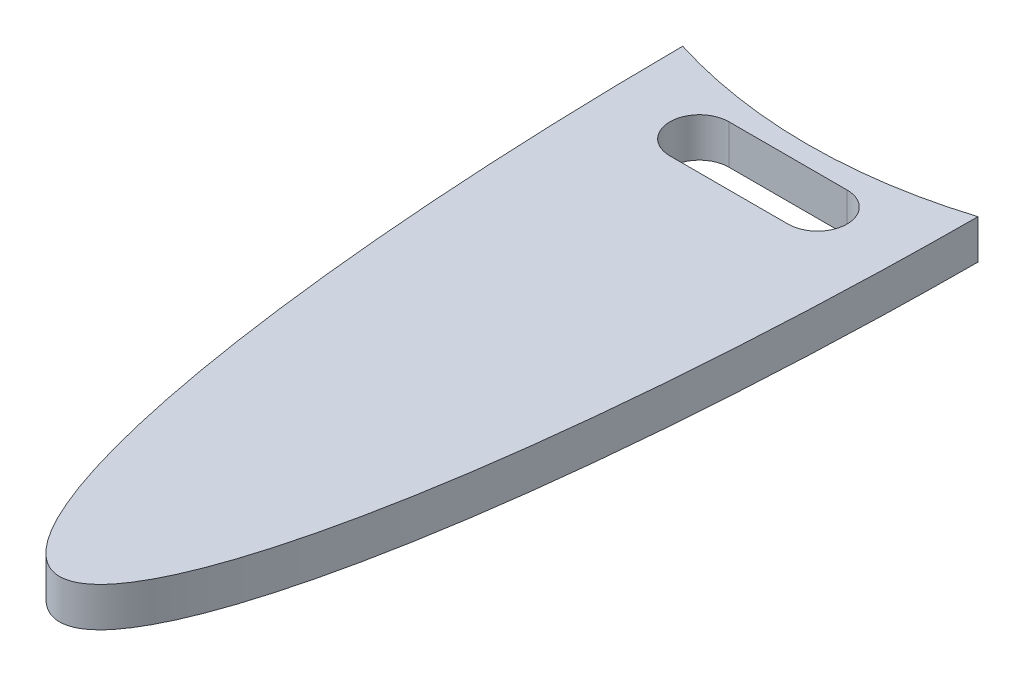
ISO-10303-21;
HEADER;
FILE_DESCRIPTION(('STEP AP214'),'2;1');
FILE_NAME('part.step','',(''),(''),'','','');
FILE_SCHEMA(('AUTOMOTIVE_DESIGN { 1 0 10303 214 1 1 1 1 }'));
ENDSEC;
DATA;
#1=APPLICATION_CONTEXT('core data for automotive mechanical design processes');
#2=APPLICATION_PROTOCOL_DEFINITION('international standard','automotive_design',2000,#1);
#3=PRODUCT_CONTEXT('',#1,'mechanical');
#4=PRODUCT('Part','Part','',(#3));
#5=PRODUCT_RELATED_PRODUCT_CATEGORY('part','',(#4));
#6=PRODUCT_DEFINITION_FORMATION('','',#4);
#7=PRODUCT_DEFINITION_CONTEXT('part definition',#1,'design');
#8=PRODUCT_DEFINITION('design','',#6,#7);
#9=PRODUCT_DEFINITION_SHAPE('','',#8);
#10=(LENGTH_UNIT() NAMED_UNIT(*) SI_UNIT(.MILLI.,.METRE.));
#11=(NAMED_UNIT(*) PLANE_ANGLE_UNIT() SI_UNIT($,.RADIAN.));
#12=(NAMED_UNIT(*) SI_UNIT($,.STERADIAN.) SOLID_ANGLE_UNIT());
#13=UNCERTAINTY_MEASURE_WITH_UNIT(LENGTH_MEASURE(1.E-05),#10,'distance_accuracy_value','');
#14=(GEOMETRIC_REPRESENTATION_CONTEXT(3) GLOBAL_UNCERTAINTY_ASSIGNED_CONTEXT((#13)) GLOBAL_UNIT_ASSIGNED_CONTEXT((#10,
#11,#12)) REPRESENTATION_CONTEXT('',''));
#15=CARTESIAN_POINT('',(0.,0.,0.));
#16=DIRECTION('',(0.,0.,1.));
#17=DIRECTION('',(1.,0.,0.));
#18=AXIS2_PLACEMENT_3D('',#15,#16,#17);
#19=CARTESIAN_POINT('',(0.,2.54,0.));
#20=DIRECTION('',(0.,1.,0.));
#21=DIRECTION('',(0.,0.,-1.));
#22=AXIS2_PLACEMENT_3D('',#19,#20,#21);
#23=ELLIPSE('',#22,50.8,9.525);
#24=DIRECTION('',(0.,-1.,0.));
#25=VECTOR('',#24,1.);
#26=SURFACE_OF_LINEAR_EXTRUSION('',#23,#25);
#27=CARTESIAN_POINT('',(0.,0.,0.));
#28=DIRECTION('',(0.,1.,0.));
#29=DIRECTION('',(0.,0.,-1.));
#30=AXIS2_PLACEMENT_3D('',#27,#28,#29);
#31=ELLIPSE('',#30,50.8,9.525);
#32=CARTESIAN_POINT('',(-9.52285419181197,0.,1.07824438691502));
#33=VERTEX_POINT('',#32);
#34=CARTESIAN_POINT('',(9.52285419181197,0.,1.07824438691502));
#35=VERTEX_POINT('',#34);
#36=EDGE_CURVE('E102',#33,#35,#31,.T.);
#37=ORIENTED_EDGE('',*,*,#36,.T.);
#38=DIRECTION('',(0.,-1.,0.));
#39=VECTOR('',#38,1.);
#40=CARTESIAN_POINT('',(9.52285419181197,2.54,1.07824438691505));
#41=LINE('',#40,#39);
#42=CARTESIAN_POINT('',(9.52285419181197,2.54,1.07824438691502));
#43=VERTEX_POINT('',#42);
#44=EDGE_CURVE('E59',#35,#43,#41,.F.);
#45=ORIENTED_EDGE('',*,*,#44,.T.);
#46=CARTESIAN_POINT('',(-9.52285419181197,2.54,1.07824438691502));
#47=VERTEX_POINT('',#46);
#48=EDGE_CURVE('E52',#47,#43,#23,.T.);
#49=ORIENTED_EDGE('',*,*,#48,.F.);
#50=DIRECTION('',(0.,-1.,0.));
#51=VECTOR('',#50,1.);
#52=CARTESIAN_POINT('',(-9.52285419181197,2.54,1.07824438691501));
#53=LINE('',#52,#51);
#54=EDGE_CURVE('E95',#47,#33,#53,.T.);
#55=ORIENTED_EDGE('',*,*,#54,.T.);
#56=EDGE_LOOP('',(#37,#45,#49,#55));
#57=FACE_BOUND('',#56,.T.);
#58=ADVANCED_FACE('F44',(#57),#26,.F.);
#59=CARTESIAN_POINT('',(0.,2.54,0.));
#60=DIRECTION('',(0.,1.,0.));
#61=DIRECTION('',(0.,0.,1.));
#62=AXIS2_PLACEMENT_3D('',#59,#60,#61);
#63=PLANE('',#62);
#64=CARTESIAN_POINT('',(0.,2.54,-29.21));
#65=DIRECTION('',(0.,1.,0.));
#66=DIRECTION('',(0.,0.,1.));
#67=AXIS2_PLACEMENT_3D('',#64,#65,#66);
#68=CIRCLE('',#67,31.75);
#69=EDGE_CURVE('E104',#47,#43,#68,.T.);
#70=ORIENTED_EDGE('',*,*,#69,.F.);
#71=ORIENTED_EDGE('',*,*,#48,.T.);
#72=EDGE_LOOP('',(#70,#71));
#73=FACE_BOUND('',#72,.T.);
#74=CARTESIAN_POINT('',(-3.81,2.54,5.715));
#75=DIRECTION('',(0.,1.,0.));
#76=DIRECTION('',(0.,0.,1.));
#77=AXIS2_PLACEMENT_3D('',#74,#75,#76);
#78=CIRCLE('',#77,1.905);
#79=CARTESIAN_POINT('',(-3.81,2.54,3.81));
#80=VERTEX_POINT('',#79);
#81=CARTESIAN_POINT('',(-3.81,2.54,7.62));
#82=VERTEX_POINT('',#81);
#83=EDGE_CURVE('E66',#80,#82,#78,.T.);
#84=ORIENTED_EDGE('',*,*,#83,.F.);
#85=DIRECTION('',(-1.,0.,0.));
#86=VECTOR('',#85,1.);
#87=CARTESIAN_POINT('',(-3.81,2.54,3.81));
#88=LINE('',#87,#86);
#89=CARTESIAN_POINT('',(3.81,2.54,3.81));
#90=VERTEX_POINT('',#89);
#91=EDGE_CURVE('E118',#90,#80,#88,.T.);
#92=ORIENTED_EDGE('',*,*,#91,.F.);
#93=CARTESIAN_POINT('',(3.81,2.54,5.715));
#94=DIRECTION('',(0.,1.,0.));
#95=DIRECTION('',(0.,0.,1.));
#96=AXIS2_PLACEMENT_3D('',#93,#94,#95);
#97=CIRCLE('',#96,1.905);
#98=CARTESIAN_POINT('',(3.81,2.54,7.62));
#99=VERTEX_POINT('',#98);
#100=EDGE_CURVE('E122',#99,#90,#97,.T.);
#101=ORIENTED_EDGE('',*,*,#100,.F.);
#102=DIRECTION('',(1.,0.,0.));
#103=VECTOR('',#102,1.);
#104=CARTESIAN_POINT('',(-3.81,2.54,7.62));
#105=LINE('',#104,#103);
#106=EDGE_CURVE('E125',#82,#99,#105,.T.);
#107=ORIENTED_EDGE('',*,*,#106,.F.);
#108=EDGE_LOOP('',(#84,#92,#101,#107));
#109=FACE_BOUND('',#108,.T.);
#110=ADVANCED_FACE('F141',(#73,#109),#63,.T.);
#111=CARTESIAN_POINT('',(0.,0.,0.));
#112=DIRECTION('',(0.,1.,0.));
#113=DIRECTION('',(0.,0.,1.));
#114=AXIS2_PLACEMENT_3D('',#111,#112,#113);
#115=PLANE('',#114);
#116=DIRECTION('',(-1.,0.,0.));
#117=VECTOR('',#116,1.);
#118=CARTESIAN_POINT('',(-3.81,0.,3.81));
#119=LINE('',#118,#117);
#120=CARTESIAN_POINT('',(3.81,0.,3.81));
#121=VERTEX_POINT('',#120);
#122=CARTESIAN_POINT('',(-3.81,0.,3.81));
#123=VERTEX_POINT('',#122);
#124=EDGE_CURVE('E115',#121,#123,#119,.T.);
#125=ORIENTED_EDGE('',*,*,#124,.T.);
#126=CARTESIAN_POINT('',(-3.81,0.,5.715));
#127=DIRECTION('',(0.,1.,0.));
#128=DIRECTION('',(0.,0.,1.));
#129=AXIS2_PLACEMENT_3D('',#126,#127,#128);
#130=CIRCLE('',#129,1.905);
#131=CARTESIAN_POINT('',(-3.81,0.,7.62));
#132=VERTEX_POINT('',#131);
#133=EDGE_CURVE('E121',#123,#132,#130,.T.);
#134=ORIENTED_EDGE('',*,*,#133,.T.);
#135=DIRECTION('',(1.,0.,0.));
#136=VECTOR('',#135,1.);
#137=CARTESIAN_POINT('',(-3.81,0.,7.62));
#138=LINE('',#137,#136);
#139=CARTESIAN_POINT('',(3.81,0.,7.62));
#140=VERTEX_POINT('',#139);
#141=EDGE_CURVE('E134',#132,#140,#138,.T.);
#142=ORIENTED_EDGE('',*,*,#141,.T.);
#143=CARTESIAN_POINT('',(3.81,0.,5.715));
#144=DIRECTION('',(0.,1.,0.));
#145=DIRECTION('',(0.,0.,1.));
#146=AXIS2_PLACEMENT_3D('',#143,#144,#145);
#147=CIRCLE('',#146,1.905);
#148=EDGE_CURVE('E131',#140,#121,#147,.T.);
#149=ORIENTED_EDGE('',*,*,#148,.T.);
#150=EDGE_LOOP('',(#125,#134,#142,#149));
#151=FACE_BOUND('',#150,.T.);
#152=ORIENTED_EDGE('',*,*,#36,.F.);
#153=CARTESIAN_POINT('',(0.,0.,-29.21));
#154=DIRECTION('',(0.,1.,0.));
#155=DIRECTION('',(0.,0.,1.));
#156=AXIS2_PLACEMENT_3D('',#153,#154,#155);
#157=CIRCLE('',#156,31.75);
#158=EDGE_CURVE('E11',#33,#35,#157,.T.);
#159=ORIENTED_EDGE('',*,*,#158,.T.);
#160=EDGE_LOOP('',(#152,#159));
#161=FACE_BOUND('',#160,.T.);
#162=ADVANCED_FACE('F106',(#151,#161),#115,.F.);
#163=CARTESIAN_POINT('',(-3.81,0.,5.715));
#164=DIRECTION('',(0.,1.,0.));
#165=DIRECTION('',(0.,0.,1.));
#166=AXIS2_PLACEMENT_3D('',#163,#164,#165);
#167=CYLINDRICAL_SURFACE('',#166,1.905);
#168=ORIENTED_EDGE('',*,*,#83,.T.);
#169=DIRECTION('',(0.,1.,0.));
#170=VECTOR('',#169,1.);
#171=CARTESIAN_POINT('',(-3.81,0.,7.62));
#172=LINE('',#171,#170);
#173=EDGE_CURVE('E112',#132,#82,#172,.T.);
#174=ORIENTED_EDGE('',*,*,#173,.F.);
#175=ORIENTED_EDGE('',*,*,#133,.F.);
#176=DIRECTION('',(0.,1.,0.));
#177=VECTOR('',#176,1.);
#178=CARTESIAN_POINT('',(-3.81,0.,3.81));
#179=LINE('',#178,#177);
#180=EDGE_CURVE('E107',#123,#80,#179,.T.);
#181=ORIENTED_EDGE('',*,*,#180,.T.);
#182=EDGE_LOOP('',(#168,#174,#175,#181));
#183=FACE_BOUND('',#182,.T.);
#184=ADVANCED_FACE('F153',(#183),#167,.F.);
#185=CARTESIAN_POINT('',(-3.81,0.,3.81));
#186=DIRECTION('',(0.,0.,-1.));
#187=DIRECTION('',(-1.,0.,0.));
#188=AXIS2_PLACEMENT_3D('',#185,#186,#187);
#189=PLANE('',#188);
#190=ORIENTED_EDGE('',*,*,#91,.T.);
#191=ORIENTED_EDGE('',*,*,#180,.F.);
#192=ORIENTED_EDGE('',*,*,#124,.F.);
#193=DIRECTION('',(0.,1.,0.));
#194=VECTOR('',#193,1.);
#195=CARTESIAN_POINT('',(3.81,0.,3.81));
#196=LINE('',#195,#194);
#197=EDGE_CURVE('E108',#121,#90,#196,.T.);
#198=ORIENTED_EDGE('',*,*,#197,.T.);
#199=EDGE_LOOP('',(#190,#191,#192,#198));
#200=FACE_BOUND('',#199,.T.);
#201=ADVANCED_FACE('F157',(#200),#189,.F.);
#202=CARTESIAN_POINT('',(3.81,0.,5.715));
#203=DIRECTION('',(0.,1.,0.));
#204=DIRECTION('',(0.,0.,1.));
#205=AXIS2_PLACEMENT_3D('',#202,#203,#204);
#206=CYLINDRICAL_SURFACE('',#205,1.905);
#207=ORIENTED_EDGE('',*,*,#100,.T.);
#208=ORIENTED_EDGE('',*,*,#197,.F.);
#209=ORIENTED_EDGE('',*,*,#148,.F.);
#210=DIRECTION('',(0.,1.,0.));
#211=VECTOR('',#210,1.);
#212=CARTESIAN_POINT('',(3.81,0.,7.62));
#213=LINE('',#212,#211);
#214=EDGE_CURVE('E114',#140,#99,#213,.T.);
#215=ORIENTED_EDGE('',*,*,#214,.T.);
#216=EDGE_LOOP('',(#207,#208,#209,#215));
#217=FACE_BOUND('',#216,.T.);
#218=ADVANCED_FACE('F159',(#217),#206,.F.);
#219=CARTESIAN_POINT('',(-3.81,0.,7.62));
#220=DIRECTION('',(0.,0.,1.));
#221=DIRECTION('',(1.,0.,0.));
#222=AXIS2_PLACEMENT_3D('',#219,#220,#221);
#223=PLANE('',#222);
#224=ORIENTED_EDGE('',*,*,#106,.T.);
#225=ORIENTED_EDGE('',*,*,#214,.F.);
#226=ORIENTED_EDGE('',*,*,#141,.F.);
#227=ORIENTED_EDGE('',*,*,#173,.T.);
#228=EDGE_LOOP('',(#224,#225,#226,#227));
#229=FACE_BOUND('',#228,.T.);
#230=ADVANCED_FACE('F150',(#229),#223,.F.);
#231=CARTESIAN_POINT('',(0.,0.,-29.21));
#232=DIRECTION('',(0.,1.,0.));
#233=DIRECTION('',(0.,0.,1.));
#234=AXIS2_PLACEMENT_3D('',#231,#232,#233);
#235=CYLINDRICAL_SURFACE('',#234,31.75);
#236=ORIENTED_EDGE('',*,*,#158,.F.);
#237=ORIENTED_EDGE('',*,*,#54,.F.);
#238=ORIENTED_EDGE('',*,*,#69,.T.);
#239=ORIENTED_EDGE('',*,*,#44,.F.);
#240=EDGE_LOOP('',(#236,#237,#238,#239));
#241=FACE_BOUND('',#240,.T.);
#242=ADVANCED_FACE('F94',(#241),#235,.F.);
#243=CLOSED_SHELL('',(#58,#110,#162,#184,#201,#218,#230,#242));
#244=MANIFOLD_SOLID_BREP('B2',#243);
#245=ADVANCED_BREP_SHAPE_REPRESENTATION('',(#18,#244),#14);
#246=SHAPE_DEFINITION_REPRESENTATION(#9,#245);
ENDSEC;
END-ISO-10303-21;
